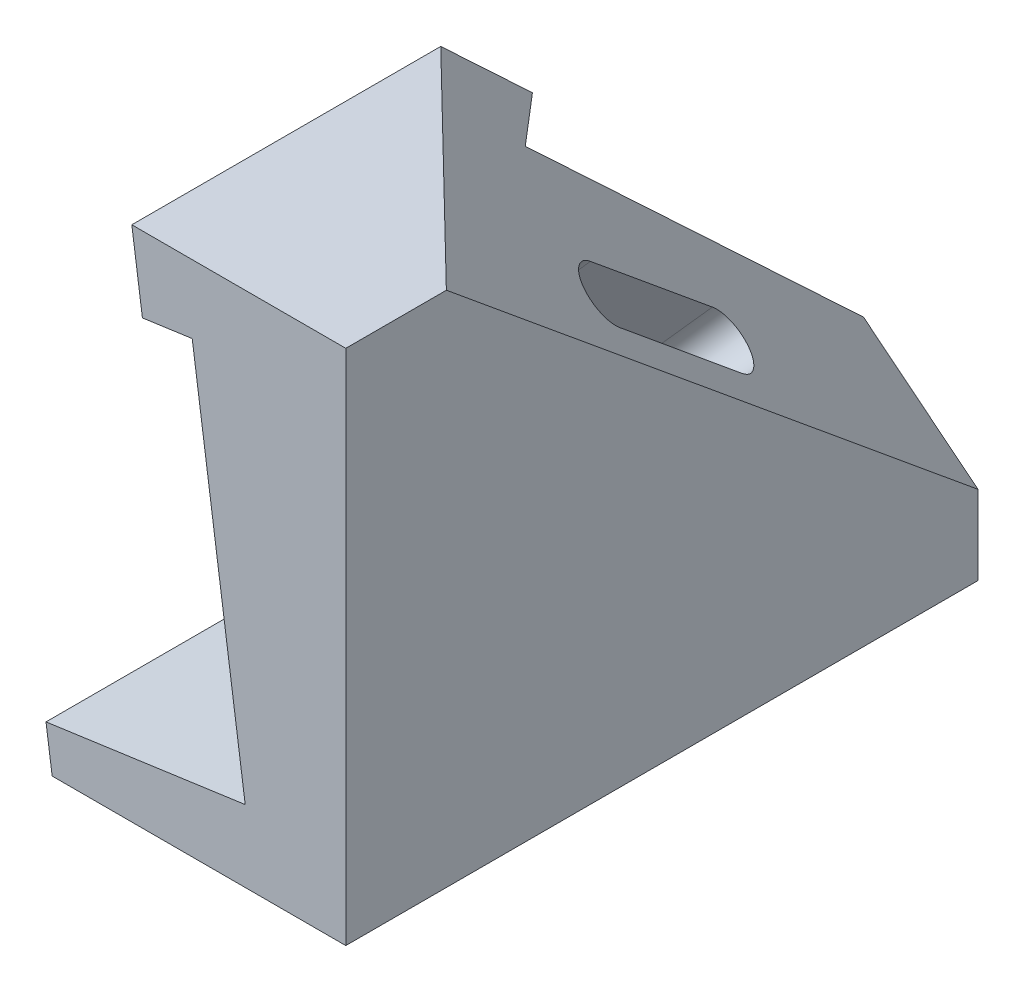
ISO-10303-21;
HEADER;
FILE_DESCRIPTION(('STEP AP214'),'2;1');
FILE_NAME('part.step','',(''),(''),'','','');
FILE_SCHEMA(('AUTOMOTIVE_DESIGN { 1 0 10303 214 1 1 1 1 }'));
ENDSEC;
DATA;
#1=APPLICATION_CONTEXT('core data for automotive mechanical design processes');
#2=APPLICATION_PROTOCOL_DEFINITION('international standard','automotive_design',2000,#1);
#3=PRODUCT_CONTEXT('',#1,'mechanical');
#4=PRODUCT('Part','Part','',(#3));
#5=PRODUCT_RELATED_PRODUCT_CATEGORY('part','',(#4));
#6=PRODUCT_DEFINITION_FORMATION('','',#4);
#7=PRODUCT_DEFINITION_CONTEXT('part definition',#1,'design');
#8=PRODUCT_DEFINITION('design','',#6,#7);
#9=PRODUCT_DEFINITION_SHAPE('','',#8);
#10=(LENGTH_UNIT() NAMED_UNIT(*) SI_UNIT(.MILLI.,.METRE.));
#11=(NAMED_UNIT(*) PLANE_ANGLE_UNIT() SI_UNIT($,.RADIAN.));
#12=(NAMED_UNIT(*) SI_UNIT($,.STERADIAN.) SOLID_ANGLE_UNIT());
#13=UNCERTAINTY_MEASURE_WITH_UNIT(LENGTH_MEASURE(1.E-05),#10,'distance_accuracy_value','');
#14=(GEOMETRIC_REPRESENTATION_CONTEXT(3) GLOBAL_UNCERTAINTY_ASSIGNED_CONTEXT((#13)) GLOBAL_UNIT_ASSIGNED_CONTEXT((#10,
#11,#12)) REPRESENTATION_CONTEXT('',''));
#15=CARTESIAN_POINT('',(0.,0.,0.));
#16=DIRECTION('',(0.,0.,1.));
#17=DIRECTION('',(1.,0.,0.));
#18=AXIS2_PLACEMENT_3D('',#15,#16,#17);
#19=CARTESIAN_POINT('',(0.362156515174074,18.5577294621563,-88.));
#20=DIRECTION('',(-0.139173100960058,0.990268068741571,0.));
#21=DIRECTION('',(-0.990268068741571,-0.139173100960058,0.));
#22=AXIS2_PLACEMENT_3D('',#19,#20,#21);
#23=PLANE('',#22);
#24=DIRECTION('',(0.,0.,1.));
#25=VECTOR('',#24,1.);
#26=CARTESIAN_POINT('',(-6.56971996601692,17.5835177554359,-88.));
#27=LINE('',#26,#25);
#28=CARTESIAN_POINT('',(-6.56971996601692,17.5835177554359,-54.2900311315946));
#29=VERTEX_POINT('',#28);
#30=CARTESIAN_POINT('',(-6.56971996601692,17.5835177554359,0.));
#31=VERTEX_POINT('',#30);
#32=EDGE_CURVE('E42',#29,#31,#27,.T.);
#33=ORIENTED_EDGE('',*,*,#32,.F.);
#34=DIRECTION('',(0.655262347972901,0.0920911173331554,0.749766951417154));
#35=VECTOR('',#34,1.);
#36=CARTESIAN_POINT('',(-20.0961084184643,15.6825078318202,-69.7672503935429));
#37=LINE('',#36,#35);
#38=CARTESIAN_POINT('',(0.362156515174074,18.5577294621563,-46.3584112041243));
#39=VERTEX_POINT('',#38);
#40=EDGE_CURVE('E176',#29,#39,#37,.T.);
#41=ORIENTED_EDGE('',*,*,#40,.T.);
#42=DIRECTION('',(0.,0.,1.));
#43=VECTOR('',#42,1.);
#44=CARTESIAN_POINT('',(0.362156515174074,18.5577294621563,-88.));
#45=LINE('',#44,#43);
#46=CARTESIAN_POINT('',(0.362156515174074,18.5577294621563,0.));
#47=VERTEX_POINT('',#46);
#48=EDGE_CURVE('E192',#39,#47,#45,.T.);
#49=ORIENTED_EDGE('',*,*,#48,.T.);
#50=DIRECTION('',(-0.990268068741571,-0.139173100960058,0.));
#51=VECTOR('',#50,1.);
#52=CARTESIAN_POINT('',(0.362156515174074,18.5577294621563,0.));
#53=LINE('',#52,#51);
#54=EDGE_CURVE('E179',#47,#31,#53,.T.);
#55=ORIENTED_EDGE('',*,*,#54,.T.);
#56=EDGE_LOOP('',(#33,#41,#49,#55));
#57=FACE_BOUND('',#56,.T.);
#58=ADVANCED_FACE('F35',(#57),#23,.F.);
#59=CARTESIAN_POINT('',(-6.56971996601692,17.5835177554359,-88.));
#60=DIRECTION('',(0.990268068741572,0.139173100960056,0.));
#61=DIRECTION('',(-0.139173100960056,0.990268068741572,0.));
#62=AXIS2_PLACEMENT_3D('',#59,#60,#61);
#63=PLANE('',#62);
#64=DIRECTION('',(0.,0.,1.));
#65=VECTOR('',#64,1.);
#66=CARTESIAN_POINT('',(-8.04399389312094,28.073521818853,-88.));
#67=LINE('',#66,#65);
#68=CARTESIAN_POINT('',(-8.04399389312095,28.073521818853,-43.));
#69=VERTEX_POINT('',#68);
#70=CARTESIAN_POINT('',(-8.04399389312094,28.073521818853,0.));
#71=VERTEX_POINT('',#70);
#72=EDGE_CURVE('E226',#69,#71,#67,.T.);
#73=ORIENTED_EDGE('',*,*,#72,.F.);
#74=DIRECTION('',(0.095227782535845,-0.677580880585386,-0.729257032669853));
#75=VECTOR('',#74,1.);
#76=CARTESIAN_POINT('',(-4.22871330762787,0.92638985843339,-72.2175258573544));
#77=LINE('',#76,#75);
#78=EDGE_CURVE('E173',#69,#29,#77,.T.);
#79=ORIENTED_EDGE('',*,*,#78,.T.);
#80=ORIENTED_EDGE('',*,*,#32,.T.);
#81=DIRECTION('',(-0.139173100960056,0.990268068741572,0.));
#82=VECTOR('',#81,1.);
#83=CARTESIAN_POINT('',(-6.56971996601692,17.5835177554359,0.));
#84=LINE('',#83,#82);
#85=EDGE_CURVE('E195',#31,#71,#84,.T.);
#86=ORIENTED_EDGE('',*,*,#85,.T.);
#87=EDGE_LOOP('',(#73,#79,#80,#86));
#88=FACE_BOUND('',#87,.T.);
#89=ADVANCED_FACE('F231',(#88),#63,.F.);
#90=CARTESIAN_POINT('',(-8.04399389312094,28.073521818853,-88.));
#91=DIRECTION('',(0.,-1.,0.));
#92=DIRECTION('',(0.,0.,-1.));
#93=AXIS2_PLACEMENT_3D('',#90,#91,#92);
#94=PLANE('',#93);
#95=DIRECTION('',(0.,0.,1.));
#96=VECTOR('',#95,1.);
#97=CARTESIAN_POINT('',(21.7383308660572,28.073521818853,-88.));
#98=LINE('',#97,#96);
#99=CARTESIAN_POINT('',(21.7383308660572,28.073521818853,-14.));
#100=VERTEX_POINT('',#99);
#101=CARTESIAN_POINT('',(21.7383308660572,28.073521818853,0.));
#102=VERTEX_POINT('',#101);
#103=EDGE_CURVE('E224',#100,#102,#98,.T.);
#104=ORIENTED_EDGE('',*,*,#103,.F.);
#105=DIRECTION('',(-0.716454106385767,0.,-0.697634226112059));
#106=VECTOR('',#105,1.);
#107=CARTESIAN_POINT('',(-30.5360246655168,28.073521818853,-64.9012081049337));
#108=LINE('',#107,#106);
#109=EDGE_CURVE('E170',#100,#69,#108,.T.);
#110=ORIENTED_EDGE('',*,*,#109,.T.);
#111=ORIENTED_EDGE('',*,*,#72,.T.);
#112=DIRECTION('',(1.,0.,0.));
#113=VECTOR('',#112,1.);
#114=CARTESIAN_POINT('',(-8.04399389312094,28.073521818853,0.));
#115=LINE('',#114,#113);
#116=EDGE_CURVE('E198',#71,#102,#115,.T.);
#117=ORIENTED_EDGE('',*,*,#116,.T.);
#118=EDGE_LOOP('',(#104,#110,#111,#117));
#119=FACE_BOUND('',#118,.T.);
#120=ADVANCED_FACE('F263',(#119),#94,.F.);
#121=CARTESIAN_POINT('',(21.7383308660572,28.073521818853,-88.));
#122=DIRECTION('',(-1.,0.,0.));
#123=DIRECTION('',(0.,-1.,0.));
#124=AXIS2_PLACEMENT_3D('',#121,#122,#123);
#125=PLANE('',#124);
#126=DIRECTION('',(0.,-1.,0.));
#127=VECTOR('',#126,1.);
#128=CARTESIAN_POINT('',(21.7383308660572,28.073521818853,-88.));
#129=LINE('',#128,#127);
#130=CARTESIAN_POINT('',(21.7383308660572,-32.926478181147,-88.));
#131=VERTEX_POINT('',#130);
#132=CARTESIAN_POINT('',(21.7383308660572,-43.926478181147,-88.));
#133=VERTEX_POINT('',#132);
#134=EDGE_CURVE('E180',#131,#133,#129,.T.);
#135=ORIENTED_EDGE('',*,*,#134,.F.);
#136=DIRECTION('',(0.,0.636072678831856,0.771629151369793));
#137=VECTOR('',#136,1.);
#138=CARTESIAN_POINT('',(21.7383308660572,-8.24658256301066,-58.0604544960313));
#139=LINE('',#138,#137);
#140=EDGE_CURVE('E167',#131,#100,#139,.T.);
#141=ORIENTED_EDGE('',*,*,#140,.T.);
#142=ORIENTED_EDGE('',*,*,#103,.T.);
#143=DIRECTION('',(0.,-1.,0.));
#144=VECTOR('',#143,1.);
#145=CARTESIAN_POINT('',(21.7383308660572,28.073521818853,0.));
#146=LINE('',#145,#144);
#147=CARTESIAN_POINT('',(21.7383308660572,-43.926478181147,0.));
#148=VERTEX_POINT('',#147);
#149=EDGE_CURVE('E201',#102,#148,#146,.T.);
#150=ORIENTED_EDGE('',*,*,#149,.T.);
#151=DIRECTION('',(0.,0.,1.));
#152=VECTOR('',#151,1.);
#153=CARTESIAN_POINT('',(21.7383308660572,-43.926478181147,-88.));
#154=LINE('',#153,#152);
#155=EDGE_CURVE('E221',#133,#148,#154,.T.);
#156=ORIENTED_EDGE('',*,*,#155,.F.);
#157=EDGE_LOOP('',(#135,#141,#142,#150,#156));
#158=FACE_BOUND('',#157,.T.);
#159=ADVANCED_FACE('F260',(#158),#125,.F.);
#160=CARTESIAN_POINT('',(21.7383308660572,-43.926478181147,-88.));
#161=DIRECTION('',(0.,1.,0.));
#162=DIRECTION('',(-1.,0.,0.));
#163=AXIS2_PLACEMENT_3D('',#160,#161,#162);
#164=PLANE('',#163);
#165=DIRECTION('',(-1.,0.,0.));
#166=VECTOR('',#165,1.);
#167=CARTESIAN_POINT('',(21.7383308660572,-43.926478181147,0.));
#168=LINE('',#167,#166);
#169=CARTESIAN_POINT('',(-19.1314328174402,-43.926478181147,0.));
#170=VERTEX_POINT('',#169);
#171=EDGE_CURVE('E203',#148,#170,#168,.T.);
#172=ORIENTED_EDGE('',*,*,#171,.T.);
#173=DIRECTION('',(0.,0.,1.));
#174=VECTOR('',#173,1.);
#175=CARTESIAN_POINT('',(-19.1314328174402,-43.926478181147,-88.));
#176=LINE('',#175,#174);
#177=CARTESIAN_POINT('',(-19.1314328174402,-43.926478181147,-88.));
#178=VERTEX_POINT('',#177);
#179=EDGE_CURVE('E218',#178,#170,#176,.T.);
#180=ORIENTED_EDGE('',*,*,#179,.F.);
#181=DIRECTION('',(-1.,0.,0.));
#182=VECTOR('',#181,1.);
#183=CARTESIAN_POINT('',(21.7383308660572,-43.926478181147,-88.));
#184=LINE('',#183,#182);
#185=EDGE_CURVE('E182',#133,#178,#184,.T.);
#186=ORIENTED_EDGE('',*,*,#185,.F.);
#187=ORIENTED_EDGE('',*,*,#155,.T.);
#188=EDGE_LOOP('',(#172,#180,#186,#187));
#189=FACE_BOUND('',#188,.T.);
#190=ADVANCED_FACE('F256',(#189),#164,.F.);
#191=CARTESIAN_POINT('',(-19.1314328174402,-43.926478181147,-88.));
#192=DIRECTION('',(0.990268068741572,0.139173100960057,0.));
#193=DIRECTION('',(-0.139173100960057,0.990268068741572,0.));
#194=AXIS2_PLACEMENT_3D('',#191,#192,#193);
#195=PLANE('',#194);
#196=DIRECTION('',(-0.139173100960057,0.990268068741571,0.));
#197=VECTOR('',#196,1.);
#198=CARTESIAN_POINT('',(-19.1314328174402,-43.926478181147,0.));
#199=LINE('',#198,#197);
#200=CARTESIAN_POINT('',(-19.9891750587068,-37.8233250080286,0.));
#201=VERTEX_POINT('',#200);
#202=EDGE_CURVE('E205',#170,#201,#199,.T.);
#203=ORIENTED_EDGE('',*,*,#202,.T.);
#204=DIRECTION('',(0.,0.,1.));
#205=VECTOR('',#204,1.);
#206=CARTESIAN_POINT('',(-19.9891750587068,-37.8233250080286,-88.));
#207=LINE('',#206,#205);
#208=CARTESIAN_POINT('',(-19.9891750587068,-37.8233250080286,-88.));
#209=VERTEX_POINT('',#208);
#210=EDGE_CURVE('E216',#209,#201,#207,.T.);
#211=ORIENTED_EDGE('',*,*,#210,.F.);
#212=DIRECTION('',(-0.139173100960057,0.990268068741571,0.));
#213=VECTOR('',#212,1.);
#214=CARTESIAN_POINT('',(-19.1314328174402,-43.926478181147,-88.));
#215=LINE('',#214,#213);
#216=EDGE_CURVE('E185',#178,#209,#215,.T.);
#217=ORIENTED_EDGE('',*,*,#216,.F.);
#218=ORIENTED_EDGE('',*,*,#179,.T.);
#219=EDGE_LOOP('',(#203,#211,#217,#218));
#220=FACE_BOUND('',#219,.T.);
#221=ADVANCED_FACE('F252',(#220),#195,.F.);
#222=CARTESIAN_POINT('',(7.73833086605719,-33.926478181147,-88.));
#223=DIRECTION('',(-0.139173100960058,0.990268068741571,0.));
#224=DIRECTION('',(-0.990268068741571,-0.139173100960058,0.));
#225=AXIS2_PLACEMENT_3D('',#222,#223,#224);
#226=PLANE('',#225);
#227=DIRECTION('',(-0.990268068741571,-0.139173100960058,0.));
#228=VECTOR('',#227,1.);
#229=CARTESIAN_POINT('',(7.73833086605719,-33.926478181147,0.));
#230=LINE('',#229,#228);
#231=CARTESIAN_POINT('',(7.73833086605719,-33.926478181147,0.));
#232=VERTEX_POINT('',#231);
#233=EDGE_CURVE('E208',#232,#201,#230,.T.);
#234=ORIENTED_EDGE('',*,*,#233,.F.);
#235=DIRECTION('',(0.,0.,1.));
#236=VECTOR('',#235,1.);
#237=CARTESIAN_POINT('',(7.73833086605719,-33.926478181147,-88.));
#238=LINE('',#237,#236);
#239=CARTESIAN_POINT('',(7.73833086605719,-33.926478181147,-88.));
#240=VERTEX_POINT('',#239);
#241=EDGE_CURVE('E214',#240,#232,#238,.T.);
#242=ORIENTED_EDGE('',*,*,#241,.F.);
#243=DIRECTION('',(-0.990268068741571,-0.139173100960058,0.));
#244=VECTOR('',#243,1.);
#245=CARTESIAN_POINT('',(7.73833086605719,-33.926478181147,-88.));
#246=LINE('',#245,#244);
#247=EDGE_CURVE('E187',#240,#209,#246,.T.);
#248=ORIENTED_EDGE('',*,*,#247,.T.);
#249=ORIENTED_EDGE('',*,*,#210,.T.);
#250=EDGE_LOOP('',(#234,#242,#248,#249));
#251=FACE_BOUND('',#250,.T.);
#252=ADVANCED_FACE('F247',(#251),#226,.T.);
#253=CARTESIAN_POINT('',(0.362156515174074,18.5577294621563,-88.));
#254=DIRECTION('',(-0.990268068741571,-0.139173100960059,0.));
#255=DIRECTION('',(0.139173100960059,-0.990268068741571,0.));
#256=AXIS2_PLACEMENT_3D('',#253,#254,#255);
#257=PLANE('',#256);
#258=DIRECTION('',(0.0752924809986509,-0.535733839621015,-0.841023361976344));
#259=VECTOR('',#258,1.);
#260=CARTESIAN_POINT('',(3.91676278575027,-6.73460837049987,-22.9323596229769));
#261=LINE('',#260,#259);
#262=CARTESIAN_POINT('',(4.29462581643898,-9.42324353827079,-27.1531215399881));
#263=VERTEX_POINT('',#262);
#264=CARTESIAN_POINT('',(5.96825898490972,-21.3317623115861,-45.84774516499));
#265=VERTEX_POINT('',#264);
#266=EDGE_CURVE('E142',#263,#265,#261,.T.);
#267=ORIENTED_EDGE('',*,*,#266,.T.);
#268=CARTESIAN_POINT('',(5.26719041177207,-16.3434002129671,-49.9597733814191));
#269=DIRECTION('',(-0.990268068741571,-0.139173100960059,0.));
#270=DIRECTION('',(-0.101492962633594,0.722159953358183,-0.684239855826568));
#271=AXIS2_PLACEMENT_3D('',#268,#269,#270);
#272=ELLIPSE('',#271,6.52824686567362,4.);
#273=CARTESIAN_POINT('',(4.56612183863442,-11.3550381143482,-54.0718015978483));
#274=VERTEX_POINT('',#273);
#275=EDGE_CURVE('E129',#265,#274,#272,.F.);
#276=ORIENTED_EDGE('',*,*,#275,.T.);
#277=DIRECTION('',(-0.0752924809986509,0.535733839621015,0.841023361976344));
#278=VECTOR('',#277,1.);
#279=CARTESIAN_POINT('',(2.40423297502616,4.02760044893051,-29.9233206848122));
#280=LINE('',#279,#278);
#281=CARTESIAN_POINT('',(2.89248867016368,0.553480658967099,-35.3771779728463));
#282=VERTEX_POINT('',#281);
#283=EDGE_CURVE('E160',#274,#282,#280,.T.);
#284=ORIENTED_EDGE('',*,*,#283,.T.);
#285=CARTESIAN_POINT('',(3.59355724330133,-4.43488143965184,-31.2651497564172));
#286=DIRECTION('',(-0.990268068741571,-0.139173100960059,0.));
#287=DIRECTION('',(-0.101492962633594,0.722159953358183,-0.684239855826568));
#288=AXIS2_PLACEMENT_3D('',#285,#286,#287);
#289=ELLIPSE('',#288,6.52824686567362,4.);
#290=EDGE_CURVE('E150',#282,#263,#289,.F.);
#291=ORIENTED_EDGE('',*,*,#290,.T.);
#292=EDGE_LOOP('',(#267,#276,#284,#291));
#293=FACE_BOUND('',#292,.T.);
#294=DIRECTION('',(-0.0952277825358471,0.677580880585387,0.729257032669852));
#295=VECTOR('',#294,1.);
#296=CARTESIAN_POINT('',(3.25397872413529,-2.01865472600562,-68.5040668831482));
#297=LINE('',#296,#295);
#298=CARTESIAN_POINT('',(5.79979507696228,-20.1330793216622,-88.));
#299=VERTEX_POINT('',#298);
#300=EDGE_CURVE('E165',#299,#39,#297,.T.);
#301=ORIENTED_EDGE('',*,*,#300,.F.);
#302=DIRECTION('',(0.139173100960059,-0.990268068741571,0.));
#303=VECTOR('',#302,1.);
#304=CARTESIAN_POINT('',(0.362156515174074,18.5577294621563,-88.));
#305=LINE('',#304,#303);
#306=EDGE_CURVE('E190',#299,#240,#305,.T.);
#307=ORIENTED_EDGE('',*,*,#306,.T.);
#308=ORIENTED_EDGE('',*,*,#241,.T.);
#309=DIRECTION('',(0.139173100960059,-0.990268068741571,0.));
#310=VECTOR('',#309,1.);
#311=CARTESIAN_POINT('',(0.362156515174074,18.5577294621563,0.));
#312=LINE('',#311,#310);
#313=EDGE_CURVE('E183',#47,#232,#312,.T.);
#314=ORIENTED_EDGE('',*,*,#313,.F.);
#315=ORIENTED_EDGE('',*,*,#48,.F.);
#316=EDGE_LOOP('',(#301,#307,#308,#314,#315));
#317=FACE_BOUND('',#316,.T.);
#318=ADVANCED_FACE('F148',(#293,#317),#257,.T.);
#319=CARTESIAN_POINT('',(0.,0.,-88.));
#320=DIRECTION('',(0.,0.,-1.));
#321=DIRECTION('',(-1.,0.,0.));
#322=AXIS2_PLACEMENT_3D('',#319,#320,#321);
#323=PLANE('',#322);
#324=DIRECTION('',(-0.779851725051604,0.625964285669747,0.));
#325=VECTOR('',#324,1.);
#326=CARTESIAN_POINT('',(-7.55560930327847,-9.41308487380119,-88.));
#327=LINE('',#326,#325);
#328=EDGE_CURVE('E11',#131,#299,#327,.T.);
#329=ORIENTED_EDGE('',*,*,#328,.F.);
#330=ORIENTED_EDGE('',*,*,#134,.T.);
#331=ORIENTED_EDGE('',*,*,#185,.T.);
#332=ORIENTED_EDGE('',*,*,#216,.T.);
#333=ORIENTED_EDGE('',*,*,#247,.F.);
#334=ORIENTED_EDGE('',*,*,#306,.F.);
#335=EDGE_LOOP('',(#329,#330,#331,#332,#333,#334));
#336=FACE_BOUND('',#335,.T.);
#337=ADVANCED_FACE('F268',(#336),#323,.T.);
#338=CARTESIAN_POINT('',(0.,0.,0.));
#339=DIRECTION('',(0.,0.,-1.));
#340=DIRECTION('',(-1.,0.,0.));
#341=AXIS2_PLACEMENT_3D('',#338,#339,#340);
#342=PLANE('',#341);
#343=ORIENTED_EDGE('',*,*,#54,.F.);
#344=ORIENTED_EDGE('',*,*,#313,.T.);
#345=ORIENTED_EDGE('',*,*,#233,.T.);
#346=ORIENTED_EDGE('',*,*,#202,.F.);
#347=ORIENTED_EDGE('',*,*,#171,.F.);
#348=ORIENTED_EDGE('',*,*,#149,.F.);
#349=ORIENTED_EDGE('',*,*,#116,.F.);
#350=ORIENTED_EDGE('',*,*,#85,.F.);
#351=EDGE_LOOP('',(#343,#344,#345,#346,#347,#348,#349,#350));
#352=FACE_BOUND('',#351,.T.);
#353=ADVANCED_FACE('F236',(#352),#342,.F.);
#354=CARTESIAN_POINT('',(19.7103078933911,24.5559019321894,-20.2420272684264));
#355=DIRECTION('',(-0.526549215509057,-0.655996393787795,0.540753784068318));
#356=DIRECTION('',(0.,-0.636072678831856,-0.771629151369793));
#357=AXIS2_PLACEMENT_3D('',#354,#355,#356);
#358=PLANE('',#357);
#359=CARTESIAN_POINT('',(14.9371736767698,-4.2961424011895,-59.8906210370737));
#360=DIRECTION('',(0.526549215509057,0.655996393787795,-0.540753784068318));
#361=DIRECTION('',(0.,0.636072678831856,0.771629151369793));
#362=AXIS2_PLACEMENT_3D('',#359,#360,#361);
#363=CIRCLE('',#362,4.);
#364=CARTESIAN_POINT('',(18.3377522714135,-5.92134529846023,-58.550926756891));
#365=VERTEX_POINT('',#364);
#366=CARTESIAN_POINT('',(11.5365950821262,-2.67093950391877,-61.2303153172563));
#367=VERTEX_POINT('',#366);
#368=EDGE_CURVE('E152',#365,#367,#363,.T.);
#369=ORIENTED_EDGE('',*,*,#368,.F.);
#370=DIRECTION('',(0.,-0.636072678831856,-0.771629151369793));
#371=VECTOR('',#370,1.);
#372=CARTESIAN_POINT('',(18.3377522714135,8.0722536358406,-41.5750854267556));
#373=LINE('',#372,#371);
#374=CARTESIAN_POINT('',(18.3377522714135,8.0722536358406,-41.5750854267556));
#375=VERTEX_POINT('',#374);
#376=EDGE_CURVE('E145',#375,#365,#373,.T.);
#377=ORIENTED_EDGE('',*,*,#376,.F.);
#378=CARTESIAN_POINT('',(14.9371736767698,9.69745653311134,-42.9147797069382));
#379=DIRECTION('',(0.526549215509057,0.655996393787795,-0.540753784068318));
#380=DIRECTION('',(0.,0.636072678831856,0.771629151369793));
#381=AXIS2_PLACEMENT_3D('',#378,#379,#380);
#382=CIRCLE('',#381,4.);
#383=CARTESIAN_POINT('',(11.5365950821262,11.3226594303821,-44.2544739871209));
#384=VERTEX_POINT('',#383);
#385=EDGE_CURVE('E156',#384,#375,#382,.T.);
#386=ORIENTED_EDGE('',*,*,#385,.F.);
#387=DIRECTION('',(0.,0.636072678831856,0.771629151369793));
#388=VECTOR('',#387,1.);
#389=CARTESIAN_POINT('',(11.5365950821262,11.3226594303821,-44.2544739871208));
#390=LINE('',#389,#388);
#391=EDGE_CURVE('E57',#367,#384,#390,.T.);
#392=ORIENTED_EDGE('',*,*,#391,.F.);
#393=EDGE_LOOP('',(#369,#377,#386,#392));
#394=FACE_BOUND('',#393,.T.);
#395=ORIENTED_EDGE('',*,*,#78,.F.);
#396=ORIENTED_EDGE('',*,*,#109,.F.);
#397=ORIENTED_EDGE('',*,*,#140,.F.);
#398=ORIENTED_EDGE('',*,*,#328,.T.);
#399=ORIENTED_EDGE('',*,*,#300,.T.);
#400=ORIENTED_EDGE('',*,*,#40,.F.);
#401=EDGE_LOOP('',(#395,#396,#397,#398,#399,#400));
#402=FACE_BOUND('',#401,.T.);
#403=ADVANCED_FACE('F265',(#394,#402),#358,.F.);
#404=CARTESIAN_POINT('',(-14.1856788884763,-32.4467575526326,-8.17427890652762));
#405=DIRECTION('',(0.850144648660919,-0.406300724317684,0.334923570045658));
#406=DIRECTION('',(0.431204830671097,0.902254062892438,0.));
#407=AXIS2_PLACEMENT_3D('',#404,#405,#406);
#408=PLANE('',#407);
#409=DIRECTION('',(0.526549215509057,0.655996393787795,-0.540753784068318));
#410=VECTOR('',#409,1.);
#411=CARTESIAN_POINT('',(-14.1856788884763,-32.4467575526326,-8.17427890652762));
#412=LINE('',#411,#410);
#413=EDGE_CURVE('E49',#263,#375,#412,.T.);
#414=ORIENTED_EDGE('',*,*,#413,.T.);
#415=ORIENTED_EDGE('',*,*,#376,.T.);
#416=DIRECTION('',(0.526549215509057,0.655996393787795,-0.540753784068318));
#417=VECTOR('',#416,1.);
#418=CARTESIAN_POINT('',(-14.1856788884763,-46.4403564869335,-25.1501202366631));
#419=LINE('',#418,#417);
#420=EDGE_CURVE('E133',#265,#365,#419,.T.);
#421=ORIENTED_EDGE('',*,*,#420,.F.);
#422=ORIENTED_EDGE('',*,*,#266,.F.);
#423=EDGE_LOOP('',(#414,#415,#421,#422));
#424=FACE_BOUND('',#423,.T.);
#425=ADVANCED_FACE('F141',(#424),#408,.F.);
#426=CARTESIAN_POINT('',(-17.5862574831199,-44.8151535896627,-26.4898145168457));
#427=DIRECTION('',(0.526549215509057,0.655996393787795,-0.540753784068318));
#428=DIRECTION('',(0.,0.636072678831856,0.771629151369793));
#429=AXIS2_PLACEMENT_3D('',#426,#427,#428);
#430=CYLINDRICAL_SURFACE('',#429,4.);
#431=ORIENTED_EDGE('',*,*,#420,.T.);
#432=ORIENTED_EDGE('',*,*,#368,.T.);
#433=DIRECTION('',(0.526549215509057,0.655996393787795,-0.540753784068318));
#434=VECTOR('',#433,1.);
#435=CARTESIAN_POINT('',(-20.9868360777636,-43.189950692392,-27.8295087970283));
#436=LINE('',#435,#434);
#437=EDGE_CURVE('E135',#274,#367,#436,.T.);
#438=ORIENTED_EDGE('',*,*,#437,.F.);
#439=ORIENTED_EDGE('',*,*,#275,.F.);
#440=EDGE_LOOP('',(#431,#432,#438,#439));
#441=FACE_BOUND('',#440,.T.);
#442=ADVANCED_FACE('F131',(#441),#430,.F.);
#443=CARTESIAN_POINT('',(-20.9868360777636,-29.1963517580912,-10.8536674668929));
#444=DIRECTION('',(-0.850144648660918,0.406300724317684,-0.334923570045658));
#445=DIRECTION('',(-0.431204830671097,-0.902254062892438,0.));
#446=AXIS2_PLACEMENT_3D('',#443,#444,#445);
#447=PLANE('',#446);
#448=ORIENTED_EDGE('',*,*,#437,.T.);
#449=ORIENTED_EDGE('',*,*,#391,.T.);
#450=DIRECTION('',(0.526549215509057,0.655996393787795,-0.540753784068318));
#451=VECTOR('',#450,1.);
#452=CARTESIAN_POINT('',(-20.9868360777636,-29.1963517580912,-10.8536674668929));
#453=LINE('',#452,#451);
#454=EDGE_CURVE('E159',#282,#384,#453,.T.);
#455=ORIENTED_EDGE('',*,*,#454,.F.);
#456=ORIENTED_EDGE('',*,*,#283,.F.);
#457=EDGE_LOOP('',(#448,#449,#455,#456));
#458=FACE_BOUND('',#457,.T.);
#459=ADVANCED_FACE('F332',(#458),#447,.F.);
#460=CARTESIAN_POINT('',(-17.5862574831199,-30.8215546553619,-9.51397318671026));
#461=DIRECTION('',(0.526549215509057,0.655996393787795,-0.540753784068318));
#462=DIRECTION('',(0.,0.636072678831856,0.771629151369793));
#463=AXIS2_PLACEMENT_3D('',#460,#461,#462);
#464=CYLINDRICAL_SURFACE('',#463,4.);
#465=ORIENTED_EDGE('',*,*,#454,.T.);
#466=ORIENTED_EDGE('',*,*,#385,.T.);
#467=ORIENTED_EDGE('',*,*,#413,.F.);
#468=ORIENTED_EDGE('',*,*,#290,.F.);
#469=EDGE_LOOP('',(#465,#466,#467,#468));
#470=FACE_BOUND('',#469,.T.);
#471=ADVANCED_FACE('F341',(#470),#464,.F.);
#472=CLOSED_SHELL('',(#58,#89,#120,#159,#190,#221,#252,#318,#337,#353,#403,#425,#442,#459,#471));
#473=MANIFOLD_SOLID_BREP('B2',#472);
#474=ADVANCED_BREP_SHAPE_REPRESENTATION('',(#18,#473),#14);
#475=SHAPE_DEFINITION_REPRESENTATION(#9,#474);
ENDSEC;
END-ISO-10303-21;
